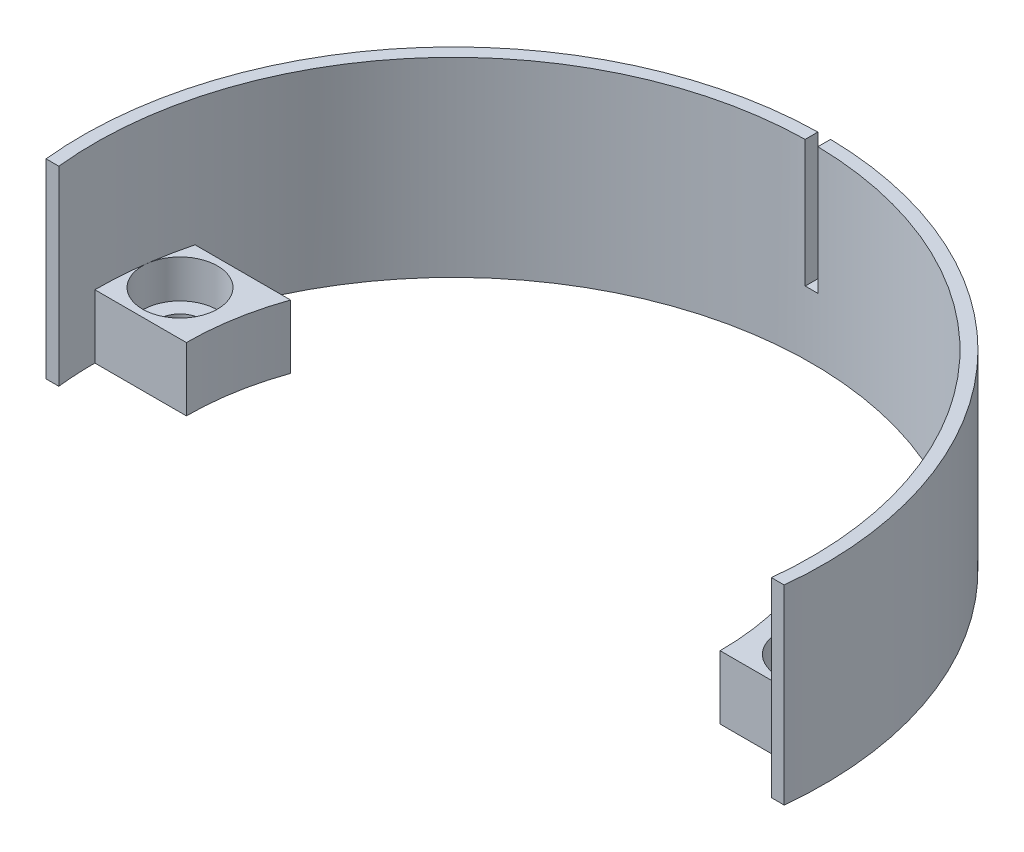
ISO-10303-21;
HEADER;
FILE_DESCRIPTION(('STEP AP214'),'2;1');
FILE_NAME('part.step','',(''),(''),'','','');
FILE_SCHEMA(('AUTOMOTIVE_DESIGN { 1 0 10303 214 1 1 1 1 }'));
ENDSEC;
DATA;
#1=APPLICATION_CONTEXT('core data for automotive mechanical design processes');
#2=APPLICATION_PROTOCOL_DEFINITION('international standard','automotive_design',2000,#1);
#3=PRODUCT_CONTEXT('',#1,'mechanical');
#4=PRODUCT('Part','Part','',(#3));
#5=PRODUCT_RELATED_PRODUCT_CATEGORY('part','',(#4));
#6=PRODUCT_DEFINITION_FORMATION('','',#4);
#7=PRODUCT_DEFINITION_CONTEXT('part definition',#1,'design');
#8=PRODUCT_DEFINITION('design','',#6,#7);
#9=PRODUCT_DEFINITION_SHAPE('','',#8);
#10=(LENGTH_UNIT() NAMED_UNIT(*) SI_UNIT(.MILLI.,.METRE.));
#11=(NAMED_UNIT(*) PLANE_ANGLE_UNIT() SI_UNIT($,.RADIAN.));
#12=(NAMED_UNIT(*) SI_UNIT($,.STERADIAN.) SOLID_ANGLE_UNIT());
#13=UNCERTAINTY_MEASURE_WITH_UNIT(LENGTH_MEASURE(1.E-05),#10,'distance_accuracy_value','');
#14=(GEOMETRIC_REPRESENTATION_CONTEXT(3) GLOBAL_UNCERTAINTY_ASSIGNED_CONTEXT((#13)) GLOBAL_UNIT_ASSIGNED_CONTEXT((#10,
#11,#12)) REPRESENTATION_CONTEXT('',''));
#15=CARTESIAN_POINT('',(0.,0.,0.));
#16=DIRECTION('',(0.,0.,1.));
#17=DIRECTION('',(1.,0.,0.));
#18=AXIS2_PLACEMENT_3D('',#15,#16,#17);
#19=CARTESIAN_POINT('',(-25.,5.,-3.5));
#20=DIRECTION('',(0.,-1.,0.));
#21=DIRECTION('',(0.,0.,-1.));
#22=AXIS2_PLACEMENT_3D('',#19,#20,#21);
#23=CYLINDRICAL_SURFACE('',#22,1.7);
#24=CARTESIAN_POINT('',(-25.,0.,-3.5));
#25=DIRECTION('',(0.,1.,0.));
#26=DIRECTION('',(0.,0.,1.));
#27=AXIS2_PLACEMENT_3D('',#24,#25,#26);
#28=CIRCLE('',#27,1.7);
#29=CARTESIAN_POINT('',(-25.,0.,-1.8));
#30=VERTEX_POINT('',#29);
#31=EDGE_CURVE('E214',#30,#30,#28,.T.);
#32=ORIENTED_EDGE('',*,*,#31,.F.);
#33=EDGE_LOOP('',(#32));
#34=FACE_BOUND('',#33,.T.);
#35=CARTESIAN_POINT('',(-25.,2.,-3.5));
#36=DIRECTION('',(0.,1.,0.));
#37=DIRECTION('',(0.,0.,1.));
#38=AXIS2_PLACEMENT_3D('',#35,#36,#37);
#39=CIRCLE('',#38,1.7);
#40=CARTESIAN_POINT('',(-25.,2.,-1.8));
#41=VERTEX_POINT('',#40);
#42=EDGE_CURVE('E40',#41,#41,#39,.T.);
#43=ORIENTED_EDGE('',*,*,#42,.T.);
#44=EDGE_LOOP('',(#43));
#45=FACE_BOUND('',#44,.T.);
#46=ADVANCED_FACE('F36',(#34,#45),#23,.F.);
#47=CARTESIAN_POINT('',(25.,5.,-3.5));
#48=DIRECTION('',(0.,-1.,0.));
#49=DIRECTION('',(0.,0.,-1.));
#50=AXIS2_PLACEMENT_3D('',#47,#48,#49);
#51=CYLINDRICAL_SURFACE('',#50,1.7);
#52=CARTESIAN_POINT('',(25.,0.,-3.5));
#53=DIRECTION('',(0.,1.,0.));
#54=DIRECTION('',(0.,0.,1.));
#55=AXIS2_PLACEMENT_3D('',#52,#53,#54);
#56=CIRCLE('',#55,1.7);
#57=CARTESIAN_POINT('',(25.,0.,-1.8));
#58=VERTEX_POINT('',#57);
#59=EDGE_CURVE('E211',#58,#58,#56,.T.);
#60=ORIENTED_EDGE('',*,*,#59,.F.);
#61=EDGE_LOOP('',(#60));
#62=FACE_BOUND('',#61,.T.);
#63=CARTESIAN_POINT('',(25.,2.,-3.5));
#64=DIRECTION('',(0.,1.,0.));
#65=DIRECTION('',(0.,0.,1.));
#66=AXIS2_PLACEMENT_3D('',#63,#64,#65);
#67=CIRCLE('',#66,1.7);
#68=CARTESIAN_POINT('',(25.,2.,-1.8));
#69=VERTEX_POINT('',#68);
#70=EDGE_CURVE('E283',#69,#69,#67,.T.);
#71=ORIENTED_EDGE('',*,*,#70,.T.);
#72=EDGE_LOOP('',(#71));
#73=FACE_BOUND('',#72,.T.);
#74=ADVANCED_FACE('F372',(#62,#73),#51,.F.);
#75=CARTESIAN_POINT('',(0.,5.,0.));
#76=DIRECTION('',(0.,1.,0.));
#77=DIRECTION('',(0.,0.,1.));
#78=AXIS2_PLACEMENT_3D('',#75,#76,#77);
#79=PLANE('',#78);
#80=CARTESIAN_POINT('',(-25.,5.,-3.5));
#81=DIRECTION('',(0.,1.,0.));
#82=DIRECTION('',(0.,0.,1.));
#83=AXIS2_PLACEMENT_3D('',#80,#81,#82);
#84=CIRCLE('',#83,2.95);
#85=CARTESIAN_POINT('',(-25.,5.,-0.549999999999999));
#86=VERTEX_POINT('',#85);
#87=EDGE_CURVE('E290',#86,#86,#84,.T.);
#88=ORIENTED_EDGE('',*,*,#87,.F.);
#89=EDGE_LOOP('',(#88));
#90=FACE_BOUND('',#89,.T.);
#91=DIRECTION('',(-1.,0.,0.));
#92=VECTOR('',#91,1.);
#93=CARTESIAN_POINT('',(-27.3173937263422,5.,-7.));
#94=LINE('',#93,#92);
#95=CARTESIAN_POINT('',(-19.7989898732233,5.,-7.));
#96=VERTEX_POINT('',#95);
#97=CARTESIAN_POINT('',(-27.3173937263422,5.,-7.00000000000001));
#98=VERTEX_POINT('',#97);
#99=EDGE_CURVE('E223',#96,#98,#94,.T.);
#100=ORIENTED_EDGE('',*,*,#99,.T.);
#101=CARTESIAN_POINT('',(0.,5.,0.));
#102=DIRECTION('',(0.,-1.,0.));
#103=DIRECTION('',(0.,0.,-1.));
#104=AXIS2_PLACEMENT_3D('',#101,#102,#103);
#105=CIRCLE('',#104,28.2);
#106=CARTESIAN_POINT('',(-28.2,5.,1.96919547510753E-13));
#107=VERTEX_POINT('',#106);
#108=EDGE_CURVE('E176',#107,#98,#105,.T.);
#109=ORIENTED_EDGE('',*,*,#108,.F.);
#110=DIRECTION('',(1.,0.,0.));
#111=VECTOR('',#110,1.);
#112=CARTESIAN_POINT('',(-28.2,5.,1.96919547510753E-13));
#113=LINE('',#112,#111);
#114=CARTESIAN_POINT('',(-21.,5.,0.));
#115=VERTEX_POINT('',#114);
#116=EDGE_CURVE('E218',#107,#115,#113,.T.);
#117=ORIENTED_EDGE('',*,*,#116,.T.);
#118=CARTESIAN_POINT('',(0.,5.,0.));
#119=DIRECTION('',(0.,-1.,0.));
#120=DIRECTION('',(0.,0.,1.));
#121=AXIS2_PLACEMENT_3D('',#118,#119,#120);
#122=CIRCLE('',#121,21.);
#123=EDGE_CURVE('E220',#115,#96,#122,.T.);
#124=ORIENTED_EDGE('',*,*,#123,.T.);
#125=EDGE_LOOP('',(#100,#109,#117,#124));
#126=FACE_BOUND('',#125,.T.);
#127=ADVANCED_FACE('F311',(#90,#126),#79,.T.);
#128=CARTESIAN_POINT('',(0.,5.,0.));
#129=DIRECTION('',(0.,1.,0.));
#130=DIRECTION('',(0.,0.,1.));
#131=AXIS2_PLACEMENT_3D('',#128,#129,#130);
#132=CIRCLE('',#131,29.2);
#133=CARTESIAN_POINT('',(0.499999999999996,5.,-29.1957188642445));
#134=VERTEX_POINT('',#133);
#135=CARTESIAN_POINT('',(-0.500000000000003,5.,-29.1957188642445));
#136=VERTEX_POINT('',#135);
#137=EDGE_CURVE('E58',#134,#136,#132,.T.);
#138=ORIENTED_EDGE('',*,*,#137,.T.);
#139=DIRECTION('',(0.,0.,-1.));
#140=VECTOR('',#139,1.);
#141=CARTESIAN_POINT('',(-0.500000000000003,5.,-29.1957188642445));
#142=LINE('',#141,#140);
#143=CARTESIAN_POINT('',(-0.500000000000003,5.,-28.1955670274602));
#144=VERTEX_POINT('',#143);
#145=EDGE_CURVE('E53',#144,#136,#142,.T.);
#146=ORIENTED_EDGE('',*,*,#145,.F.);
#147=CARTESIAN_POINT('',(0.,5.,0.));
#148=DIRECTION('',(0.,-1.,0.));
#149=DIRECTION('',(0.,0.,1.));
#150=AXIS2_PLACEMENT_3D('',#147,#148,#149);
#151=CIRCLE('',#150,28.2);
#152=CARTESIAN_POINT('',(0.499999999999996,5.,-28.1955670274602));
#153=VERTEX_POINT('',#152);
#154=EDGE_CURVE('E225',#144,#153,#151,.T.);
#155=ORIENTED_EDGE('',*,*,#154,.T.);
#156=DIRECTION('',(0.,0.,1.));
#157=VECTOR('',#156,1.);
#158=CARTESIAN_POINT('',(0.499999999999996,5.,-29.1957188642445));
#159=LINE('',#158,#157);
#160=EDGE_CURVE('E191',#134,#153,#159,.T.);
#161=ORIENTED_EDGE('',*,*,#160,.F.);
#162=EDGE_LOOP('',(#138,#146,#155,#161));
#163=FACE_BOUND('',#162,.T.);
#164=ADVANCED_FACE('F309',(#163),#79,.T.);
#165=CARTESIAN_POINT('',(25.,5.,-3.5));
#166=DIRECTION('',(0.,1.,0.));
#167=DIRECTION('',(0.,0.,1.));
#168=AXIS2_PLACEMENT_3D('',#165,#166,#167);
#169=CIRCLE('',#168,2.95);
#170=CARTESIAN_POINT('',(25.,5.,-0.549999999999999));
#171=VERTEX_POINT('',#170);
#172=EDGE_CURVE('E179',#171,#171,#169,.T.);
#173=ORIENTED_EDGE('',*,*,#172,.F.);
#174=EDGE_LOOP('',(#173));
#175=FACE_BOUND('',#174,.T.);
#176=CARTESIAN_POINT('',(0.,5.,0.));
#177=DIRECTION('',(0.,-1.,0.));
#178=DIRECTION('',(0.,0.,-1.));
#179=AXIS2_PLACEMENT_3D('',#176,#177,#178);
#180=CIRCLE('',#179,28.2);
#181=CARTESIAN_POINT('',(27.3173937263422,5.,-7.));
#182=VERTEX_POINT('',#181);
#183=CARTESIAN_POINT('',(28.2,5.,0.));
#184=VERTEX_POINT('',#183);
#185=EDGE_CURVE('E11',#182,#184,#180,.T.);
#186=ORIENTED_EDGE('',*,*,#185,.F.);
#187=DIRECTION('',(-1.,0.,0.));
#188=VECTOR('',#187,1.);
#189=CARTESIAN_POINT('',(19.7989898732233,5.,-7.));
#190=LINE('',#189,#188);
#191=CARTESIAN_POINT('',(19.7989898732233,5.,-7.));
#192=VERTEX_POINT('',#191);
#193=EDGE_CURVE('E227',#182,#192,#190,.T.);
#194=ORIENTED_EDGE('',*,*,#193,.T.);
#195=CARTESIAN_POINT('',(0.,5.,0.));
#196=DIRECTION('',(0.,-1.,0.));
#197=DIRECTION('',(0.,0.,1.));
#198=AXIS2_PLACEMENT_3D('',#195,#196,#197);
#199=CIRCLE('',#198,21.);
#200=CARTESIAN_POINT('',(21.,5.,0.));
#201=VERTEX_POINT('',#200);
#202=EDGE_CURVE('E229',#192,#201,#199,.T.);
#203=ORIENTED_EDGE('',*,*,#202,.T.);
#204=DIRECTION('',(1.,0.,0.));
#205=VECTOR('',#204,1.);
#206=CARTESIAN_POINT('',(21.,5.,0.));
#207=LINE('',#206,#205);
#208=EDGE_CURVE('E231',#201,#184,#207,.T.);
#209=ORIENTED_EDGE('',*,*,#208,.T.);
#210=EDGE_LOOP('',(#186,#194,#203,#209));
#211=FACE_BOUND('',#210,.T.);
#212=ADVANCED_FACE('F305',(#175,#211),#79,.T.);
#213=CARTESIAN_POINT('',(0.,0.,0.));
#214=DIRECTION('',(0.,1.,0.));
#215=DIRECTION('',(0.,0.,1.));
#216=AXIS2_PLACEMENT_3D('',#213,#214,#215);
#217=PLANE('',#216);
#218=CARTESIAN_POINT('',(0.,0.,0.));
#219=DIRECTION('',(0.,-1.,0.));
#220=DIRECTION('',(0.,0.,1.));
#221=AXIS2_PLACEMENT_3D('',#218,#219,#220);
#222=CIRCLE('',#221,28.2);
#223=CARTESIAN_POINT('',(-28.039971469315,0.,3.));
#224=VERTEX_POINT('',#223);
#225=CARTESIAN_POINT('',(-28.2,0.,1.96919547510753E-13));
#226=VERTEX_POINT('',#225);
#227=EDGE_CURVE('E217',#224,#226,#222,.T.);
#228=ORIENTED_EDGE('',*,*,#227,.F.);
#229=DIRECTION('',(1.,0.,0.));
#230=VECTOR('',#229,1.);
#231=CARTESIAN_POINT('',(-29.0454815763141,0.,3.));
#232=LINE('',#231,#230);
#233=CARTESIAN_POINT('',(-29.0454815763141,0.,3.));
#234=VERTEX_POINT('',#233);
#235=EDGE_CURVE('E221',#234,#224,#232,.T.);
#236=ORIENTED_EDGE('',*,*,#235,.F.);
#237=CARTESIAN_POINT('',(0.,0.,0.));
#238=DIRECTION('',(0.,1.,0.));
#239=DIRECTION('',(0.,0.,1.));
#240=AXIS2_PLACEMENT_3D('',#237,#238,#239);
#241=CIRCLE('',#240,29.2);
#242=CARTESIAN_POINT('',(29.0454815763141,0.,3.));
#243=VERTEX_POINT('',#242);
#244=EDGE_CURVE('E157',#243,#234,#241,.T.);
#245=ORIENTED_EDGE('',*,*,#244,.F.);
#246=DIRECTION('',(1.,0.,0.));
#247=VECTOR('',#246,1.);
#248=CARTESIAN_POINT('',(28.039971469315,0.,3.));
#249=LINE('',#248,#247);
#250=CARTESIAN_POINT('',(28.039971469315,0.,3.));
#251=VERTEX_POINT('',#250);
#252=EDGE_CURVE('E252',#251,#243,#249,.T.);
#253=ORIENTED_EDGE('',*,*,#252,.F.);
#254=CARTESIAN_POINT('',(0.,0.,0.));
#255=DIRECTION('',(0.,-1.,0.));
#256=DIRECTION('',(0.,0.,1.));
#257=AXIS2_PLACEMENT_3D('',#254,#255,#256);
#258=CIRCLE('',#257,28.2);
#259=CARTESIAN_POINT('',(28.2,0.,0.));
#260=VERTEX_POINT('',#259);
#261=EDGE_CURVE('E250',#260,#251,#258,.T.);
#262=ORIENTED_EDGE('',*,*,#261,.F.);
#263=DIRECTION('',(1.,0.,0.));
#264=VECTOR('',#263,1.);
#265=CARTESIAN_POINT('',(21.,0.,0.));
#266=LINE('',#265,#264);
#267=CARTESIAN_POINT('',(21.,0.,0.));
#268=VERTEX_POINT('',#267);
#269=EDGE_CURVE('E248',#268,#260,#266,.T.);
#270=ORIENTED_EDGE('',*,*,#269,.F.);
#271=CARTESIAN_POINT('',(0.,0.,0.));
#272=DIRECTION('',(0.,-1.,0.));
#273=DIRECTION('',(0.,0.,1.));
#274=AXIS2_PLACEMENT_3D('',#271,#272,#273);
#275=CIRCLE('',#274,21.);
#276=CARTESIAN_POINT('',(19.7989898732233,0.,-7.));
#277=VERTEX_POINT('',#276);
#278=EDGE_CURVE('E246',#277,#268,#275,.T.);
#279=ORIENTED_EDGE('',*,*,#278,.F.);
#280=DIRECTION('',(-1.,0.,0.));
#281=VECTOR('',#280,1.);
#282=CARTESIAN_POINT('',(19.7989898732233,0.,-7.));
#283=LINE('',#282,#281);
#284=CARTESIAN_POINT('',(27.3173937263422,0.,-7.));
#285=VERTEX_POINT('',#284);
#286=EDGE_CURVE('E244',#285,#277,#283,.T.);
#287=ORIENTED_EDGE('',*,*,#286,.F.);
#288=CARTESIAN_POINT('',(0.,0.,0.));
#289=DIRECTION('',(0.,-1.,0.));
#290=DIRECTION('',(0.,0.,1.));
#291=AXIS2_PLACEMENT_3D('',#288,#289,#290);
#292=CIRCLE('',#291,28.2);
#293=CARTESIAN_POINT('',(-27.3173937263422,0.,-7.00000000000001));
#294=VERTEX_POINT('',#293);
#295=EDGE_CURVE('E242',#294,#285,#292,.T.);
#296=ORIENTED_EDGE('',*,*,#295,.F.);
#297=DIRECTION('',(-1.,0.,0.));
#298=VECTOR('',#297,1.);
#299=CARTESIAN_POINT('',(-27.3173937263422,0.,-7.));
#300=LINE('',#299,#298);
#301=CARTESIAN_POINT('',(-19.7989898732233,0.,-7.));
#302=VERTEX_POINT('',#301);
#303=EDGE_CURVE('E240',#302,#294,#300,.T.);
#304=ORIENTED_EDGE('',*,*,#303,.F.);
#305=CARTESIAN_POINT('',(0.,0.,0.));
#306=DIRECTION('',(0.,-1.,0.));
#307=DIRECTION('',(0.,0.,1.));
#308=AXIS2_PLACEMENT_3D('',#305,#306,#307);
#309=CIRCLE('',#308,21.);
#310=CARTESIAN_POINT('',(-21.,0.,0.));
#311=VERTEX_POINT('',#310);
#312=EDGE_CURVE('E238',#311,#302,#309,.T.);
#313=ORIENTED_EDGE('',*,*,#312,.F.);
#314=DIRECTION('',(1.,0.,0.));
#315=VECTOR('',#314,1.);
#316=CARTESIAN_POINT('',(-28.2,0.,1.96919547510753E-13));
#317=LINE('',#316,#315);
#318=EDGE_CURVE('E236',#226,#311,#317,.T.);
#319=ORIENTED_EDGE('',*,*,#318,.F.);
#320=EDGE_LOOP('',(#228,#236,#245,#253,#262,#270,#279,#287,#296,#304,#313,#319));
#321=FACE_BOUND('',#320,.T.);
#322=ORIENTED_EDGE('',*,*,#31,.T.);
#323=EDGE_LOOP('',(#322));
#324=FACE_BOUND('',#323,.T.);
#325=ORIENTED_EDGE('',*,*,#59,.T.);
#326=EDGE_LOOP('',(#325));
#327=FACE_BOUND('',#326,.T.);
#328=ADVANCED_FACE('F308',(#321,#324,#327),#217,.F.);
#329=CARTESIAN_POINT('',(-28.2,5.,1.96919547510753E-13));
#330=DIRECTION('',(0.,0.,-1.));
#331=DIRECTION('',(-1.,0.,0.));
#332=AXIS2_PLACEMENT_3D('',#329,#330,#331);
#333=PLANE('',#332);
#334=ORIENTED_EDGE('',*,*,#318,.T.);
#335=DIRECTION('',(0.,-1.,0.));
#336=VECTOR('',#335,1.);
#337=CARTESIAN_POINT('',(-21.,5.,0.));
#338=LINE('',#337,#336);
#339=EDGE_CURVE('E279',#115,#311,#338,.T.);
#340=ORIENTED_EDGE('',*,*,#339,.F.);
#341=ORIENTED_EDGE('',*,*,#116,.F.);
#342=DIRECTION('',(0.,-1.,0.));
#343=VECTOR('',#342,1.);
#344=CARTESIAN_POINT('',(-28.2,5.,1.96919547510753E-13));
#345=LINE('',#344,#343);
#346=EDGE_CURVE('E45',#107,#226,#345,.T.);
#347=ORIENTED_EDGE('',*,*,#346,.T.);
#348=EDGE_LOOP('',(#334,#340,#341,#347));
#349=FACE_BOUND('',#348,.T.);
#350=ADVANCED_FACE('F38',(#349),#333,.F.);
#351=CARTESIAN_POINT('',(0.,5.,0.));
#352=DIRECTION('',(0.,-1.,0.));
#353=DIRECTION('',(0.,0.,-1.));
#354=AXIS2_PLACEMENT_3D('',#351,#352,#353);
#355=CYLINDRICAL_SURFACE('',#354,21.);
#356=ORIENTED_EDGE('',*,*,#312,.T.);
#357=DIRECTION('',(0.,-1.,0.));
#358=VECTOR('',#357,1.);
#359=CARTESIAN_POINT('',(-19.7989898732233,5.,-7.));
#360=LINE('',#359,#358);
#361=EDGE_CURVE('E276',#96,#302,#360,.T.);
#362=ORIENTED_EDGE('',*,*,#361,.F.);
#363=ORIENTED_EDGE('',*,*,#123,.F.);
#364=ORIENTED_EDGE('',*,*,#339,.T.);
#365=EDGE_LOOP('',(#356,#362,#363,#364));
#366=FACE_BOUND('',#365,.T.);
#367=ADVANCED_FACE('F364',(#366),#355,.F.);
#368=CARTESIAN_POINT('',(-27.3173937263422,5.,-7.));
#369=DIRECTION('',(0.,0.,1.));
#370=DIRECTION('',(1.,0.,0.));
#371=AXIS2_PLACEMENT_3D('',#368,#369,#370);
#372=PLANE('',#371);
#373=ORIENTED_EDGE('',*,*,#303,.T.);
#374=DIRECTION('',(0.,-1.,0.));
#375=VECTOR('',#374,1.);
#376=CARTESIAN_POINT('',(-27.3173937263422,5.,-7.00000000000001));
#377=LINE('',#376,#375);
#378=EDGE_CURVE('E273',#98,#294,#377,.T.);
#379=ORIENTED_EDGE('',*,*,#378,.F.);
#380=ORIENTED_EDGE('',*,*,#99,.F.);
#381=ORIENTED_EDGE('',*,*,#361,.T.);
#382=EDGE_LOOP('',(#373,#379,#380,#381));
#383=FACE_BOUND('',#382,.T.);
#384=ADVANCED_FACE('F362',(#383),#372,.F.);
#385=CARTESIAN_POINT('',(19.7989898732233,5.,-7.));
#386=DIRECTION('',(0.,0.,1.));
#387=DIRECTION('',(1.,0.,0.));
#388=AXIS2_PLACEMENT_3D('',#385,#386,#387);
#389=PLANE('',#388);
#390=ORIENTED_EDGE('',*,*,#286,.T.);
#391=DIRECTION('',(0.,-1.,0.));
#392=VECTOR('',#391,1.);
#393=CARTESIAN_POINT('',(19.7989898732233,5.,-7.));
#394=LINE('',#393,#392);
#395=EDGE_CURVE('E267',#192,#277,#394,.T.);
#396=ORIENTED_EDGE('',*,*,#395,.F.);
#397=ORIENTED_EDGE('',*,*,#193,.F.);
#398=DIRECTION('',(0.,-1.,0.));
#399=VECTOR('',#398,1.);
#400=CARTESIAN_POINT('',(27.3173937263422,5.,-7.));
#401=LINE('',#400,#399);
#402=EDGE_CURVE('E270',#182,#285,#401,.T.);
#403=ORIENTED_EDGE('',*,*,#402,.T.);
#404=EDGE_LOOP('',(#390,#396,#397,#403));
#405=FACE_BOUND('',#404,.T.);
#406=ADVANCED_FACE('F322',(#405),#389,.F.);
#407=CARTESIAN_POINT('',(0.,5.,0.));
#408=DIRECTION('',(0.,-1.,0.));
#409=DIRECTION('',(0.,0.,-1.));
#410=AXIS2_PLACEMENT_3D('',#407,#408,#409);
#411=CYLINDRICAL_SURFACE('',#410,21.);
#412=ORIENTED_EDGE('',*,*,#278,.T.);
#413=DIRECTION('',(0.,-1.,0.));
#414=VECTOR('',#413,1.);
#415=CARTESIAN_POINT('',(21.,5.,0.));
#416=LINE('',#415,#414);
#417=EDGE_CURVE('E264',#201,#268,#416,.T.);
#418=ORIENTED_EDGE('',*,*,#417,.F.);
#419=ORIENTED_EDGE('',*,*,#202,.F.);
#420=ORIENTED_EDGE('',*,*,#395,.T.);
#421=EDGE_LOOP('',(#412,#418,#419,#420));
#422=FACE_BOUND('',#421,.T.);
#423=ADVANCED_FACE('F327',(#422),#411,.F.);
#424=CARTESIAN_POINT('',(21.,5.,0.));
#425=DIRECTION('',(0.,0.,-1.));
#426=DIRECTION('',(-1.,0.,0.));
#427=AXIS2_PLACEMENT_3D('',#424,#425,#426);
#428=PLANE('',#427);
#429=ORIENTED_EDGE('',*,*,#269,.T.);
#430=DIRECTION('',(0.,-1.,0.));
#431=VECTOR('',#430,1.);
#432=CARTESIAN_POINT('',(28.2,5.,0.));
#433=LINE('',#432,#431);
#434=EDGE_CURVE('E261',#184,#260,#433,.T.);
#435=ORIENTED_EDGE('',*,*,#434,.F.);
#436=ORIENTED_EDGE('',*,*,#208,.F.);
#437=ORIENTED_EDGE('',*,*,#417,.T.);
#438=EDGE_LOOP('',(#429,#435,#436,#437));
#439=FACE_BOUND('',#438,.T.);
#440=ADVANCED_FACE('F330',(#439),#428,.F.);
#441=CARTESIAN_POINT('',(0.,5.,0.));
#442=DIRECTION('',(0.,-1.,0.));
#443=DIRECTION('',(0.,0.,-1.));
#444=AXIS2_PLACEMENT_3D('',#441,#442,#443);
#445=CYLINDRICAL_SURFACE('',#444,28.2);
#446=ORIENTED_EDGE('',*,*,#261,.T.);
#447=DIRECTION('',(0.,-1.,0.));
#448=VECTOR('',#447,1.);
#449=CARTESIAN_POINT('',(28.039971469315,5.,3.));
#450=LINE('',#449,#448);
#451=CARTESIAN_POINT('',(28.039971469315,15.,3.));
#452=VERTEX_POINT('',#451);
#453=EDGE_CURVE('E258',#452,#251,#450,.T.);
#454=ORIENTED_EDGE('',*,*,#453,.F.);
#455=CARTESIAN_POINT('',(0.,15.,0.));
#456=DIRECTION('',(0.,-1.,0.));
#457=DIRECTION('',(0.,0.,-1.));
#458=AXIS2_PLACEMENT_3D('',#455,#456,#457);
#459=CIRCLE('',#458,28.2);
#460=CARTESIAN_POINT('',(0.499999999999996,15.,-28.1955670274602));
#461=VERTEX_POINT('',#460);
#462=EDGE_CURVE('E197',#461,#452,#459,.T.);
#463=ORIENTED_EDGE('',*,*,#462,.F.);
#464=DIRECTION('',(0.,-1.,0.));
#465=VECTOR('',#464,1.);
#466=CARTESIAN_POINT('',(0.499999999999996,15.,-28.1955670274602));
#467=LINE('',#466,#465);
#468=EDGE_CURVE('E203',#461,#153,#467,.T.);
#469=ORIENTED_EDGE('',*,*,#468,.T.);
#470=ORIENTED_EDGE('',*,*,#154,.F.);
#471=DIRECTION('',(0.,-1.,0.));
#472=VECTOR('',#471,1.);
#473=CARTESIAN_POINT('',(-0.500000000000018,15.,-28.1955670274602));
#474=LINE('',#473,#472);
#475=CARTESIAN_POINT('',(-0.500000000000018,15.,-28.1955670274602));
#476=VERTEX_POINT('',#475);
#477=EDGE_CURVE('E188',#476,#144,#474,.T.);
#478=ORIENTED_EDGE('',*,*,#477,.F.);
#479=CARTESIAN_POINT('',(0.,15.,0.));
#480=DIRECTION('',(0.,-1.,0.));
#481=DIRECTION('',(0.,0.,-1.));
#482=AXIS2_PLACEMENT_3D('',#479,#480,#481);
#483=CIRCLE('',#482,28.2);
#484=CARTESIAN_POINT('',(-28.039971469315,15.,3.));
#485=VERTEX_POINT('',#484);
#486=EDGE_CURVE('E169',#485,#476,#483,.T.);
#487=ORIENTED_EDGE('',*,*,#486,.F.);
#488=DIRECTION('',(0.,-1.,0.));
#489=VECTOR('',#488,1.);
#490=CARTESIAN_POINT('',(-28.039971469315,5.,3.));
#491=LINE('',#490,#489);
#492=EDGE_CURVE('E161',#485,#224,#491,.T.);
#493=ORIENTED_EDGE('',*,*,#492,.T.);
#494=ORIENTED_EDGE('',*,*,#227,.T.);
#495=ORIENTED_EDGE('',*,*,#346,.F.);
#496=ORIENTED_EDGE('',*,*,#108,.T.);
#497=ORIENTED_EDGE('',*,*,#378,.T.);
#498=ORIENTED_EDGE('',*,*,#295,.T.);
#499=ORIENTED_EDGE('',*,*,#402,.F.);
#500=ORIENTED_EDGE('',*,*,#185,.T.);
#501=ORIENTED_EDGE('',*,*,#434,.T.);
#502=EDGE_LOOP('',(#446,#454,#463,#469,#470,#478,#487,#493,#494,#495,#496,#497,#498,#499,#500,#501));
#503=FACE_BOUND('',#502,.T.);
#504=ADVANCED_FACE('F318',(#503),#445,.F.);
#505=CARTESIAN_POINT('',(28.039971469315,5.,3.));
#506=DIRECTION('',(0.,0.,-1.));
#507=DIRECTION('',(-1.,0.,0.));
#508=AXIS2_PLACEMENT_3D('',#505,#506,#507);
#509=PLANE('',#508);
#510=ORIENTED_EDGE('',*,*,#252,.T.);
#511=DIRECTION('',(0.,-1.,0.));
#512=VECTOR('',#511,1.);
#513=CARTESIAN_POINT('',(29.0454815763141,5.,3.));
#514=LINE('',#513,#512);
#515=CARTESIAN_POINT('',(29.0454815763141,15.,3.));
#516=VERTEX_POINT('',#515);
#517=EDGE_CURVE('E160',#516,#243,#514,.T.);
#518=ORIENTED_EDGE('',*,*,#517,.F.);
#519=DIRECTION('',(1.,0.,0.));
#520=VECTOR('',#519,1.);
#521=CARTESIAN_POINT('',(28.039971469315,15.,3.));
#522=LINE('',#521,#520);
#523=EDGE_CURVE('E200',#452,#516,#522,.T.);
#524=ORIENTED_EDGE('',*,*,#523,.F.);
#525=ORIENTED_EDGE('',*,*,#453,.T.);
#526=EDGE_LOOP('',(#510,#518,#524,#525));
#527=FACE_BOUND('',#526,.T.);
#528=ADVANCED_FACE('F337',(#527),#509,.F.);
#529=CARTESIAN_POINT('',(0.,5.,0.));
#530=DIRECTION('',(0.,-1.,0.));
#531=DIRECTION('',(0.,0.,-1.));
#532=AXIS2_PLACEMENT_3D('',#529,#530,#531);
#533=CYLINDRICAL_SURFACE('',#532,29.2);
#534=ORIENTED_EDGE('',*,*,#244,.T.);
#535=DIRECTION('',(0.,-1.,0.));
#536=VECTOR('',#535,1.);
#537=CARTESIAN_POINT('',(-29.0454815763141,5.,3.));
#538=LINE('',#537,#536);
#539=CARTESIAN_POINT('',(-29.0454815763141,15.,3.));
#540=VERTEX_POINT('',#539);
#541=EDGE_CURVE('E149',#540,#234,#538,.T.);
#542=ORIENTED_EDGE('',*,*,#541,.F.);
#543=CARTESIAN_POINT('',(0.,15.,0.));
#544=DIRECTION('',(0.,1.,0.));
#545=DIRECTION('',(0.,0.,1.));
#546=AXIS2_PLACEMENT_3D('',#543,#544,#545);
#547=CIRCLE('',#546,29.2);
#548=CARTESIAN_POINT('',(-0.500000000000003,15.,-29.1957188642445));
#549=VERTEX_POINT('',#548);
#550=EDGE_CURVE('E154',#549,#540,#547,.T.);
#551=ORIENTED_EDGE('',*,*,#550,.F.);
#552=DIRECTION('',(0.,-1.,0.));
#553=VECTOR('',#552,1.);
#554=CARTESIAN_POINT('',(-0.500000000000003,15.,-29.1957188642445));
#555=LINE('',#554,#553);
#556=EDGE_CURVE('E184',#549,#136,#555,.T.);
#557=ORIENTED_EDGE('',*,*,#556,.T.);
#558=ORIENTED_EDGE('',*,*,#137,.F.);
#559=DIRECTION('',(0.,-1.,0.));
#560=VECTOR('',#559,1.);
#561=CARTESIAN_POINT('',(0.499999999999996,15.,-29.1957188642445));
#562=LINE('',#561,#560);
#563=CARTESIAN_POINT('',(0.499999999999996,15.,-29.1957188642445));
#564=VERTEX_POINT('',#563);
#565=EDGE_CURVE('E208',#564,#134,#562,.T.);
#566=ORIENTED_EDGE('',*,*,#565,.F.);
#567=CARTESIAN_POINT('',(0.,15.,0.));
#568=DIRECTION('',(0.,1.,0.));
#569=DIRECTION('',(0.,0.,1.));
#570=AXIS2_PLACEMENT_3D('',#567,#568,#569);
#571=CIRCLE('',#570,29.2);
#572=EDGE_CURVE('E192',#516,#564,#571,.T.);
#573=ORIENTED_EDGE('',*,*,#572,.F.);
#574=ORIENTED_EDGE('',*,*,#517,.T.);
#575=EDGE_LOOP('',(#534,#542,#551,#557,#558,#566,#573,#574));
#576=FACE_BOUND('',#575,.T.);
#577=ADVANCED_FACE('F151',(#576),#533,.T.);
#578=CARTESIAN_POINT('',(-29.0454815763141,5.,3.));
#579=DIRECTION('',(0.,0.,-1.));
#580=DIRECTION('',(-1.,0.,0.));
#581=AXIS2_PLACEMENT_3D('',#578,#579,#580);
#582=PLANE('',#581);
#583=ORIENTED_EDGE('',*,*,#235,.T.);
#584=ORIENTED_EDGE('',*,*,#492,.F.);
#585=DIRECTION('',(1.,0.,0.));
#586=VECTOR('',#585,1.);
#587=CARTESIAN_POINT('',(-29.0454815763141,15.,3.));
#588=LINE('',#587,#586);
#589=EDGE_CURVE('E164',#540,#485,#588,.T.);
#590=ORIENTED_EDGE('',*,*,#589,.F.);
#591=ORIENTED_EDGE('',*,*,#541,.T.);
#592=EDGE_LOOP('',(#583,#584,#590,#591));
#593=FACE_BOUND('',#592,.T.);
#594=ADVANCED_FACE('F165',(#593),#582,.F.);
#595=CARTESIAN_POINT('',(0.499999999999996,15.,-29.1957188642445));
#596=DIRECTION('',(1.,0.,0.));
#597=DIRECTION('',(0.,0.,-1.));
#598=AXIS2_PLACEMENT_3D('',#595,#596,#597);
#599=PLANE('',#598);
#600=ORIENTED_EDGE('',*,*,#160,.T.);
#601=ORIENTED_EDGE('',*,*,#468,.F.);
#602=DIRECTION('',(0.,0.,1.));
#603=VECTOR('',#602,1.);
#604=CARTESIAN_POINT('',(0.499999999999996,15.,-29.1957188642445));
#605=LINE('',#604,#603);
#606=EDGE_CURVE('E195',#564,#461,#605,.T.);
#607=ORIENTED_EDGE('',*,*,#606,.F.);
#608=ORIENTED_EDGE('',*,*,#565,.T.);
#609=EDGE_LOOP('',(#600,#601,#607,#608));
#610=FACE_BOUND('',#609,.T.);
#611=ADVANCED_FACE('F347',(#610),#599,.F.);
#612=CARTESIAN_POINT('',(0.,15.,0.));
#613=DIRECTION('',(0.,1.,0.));
#614=DIRECTION('',(0.,0.,1.));
#615=AXIS2_PLACEMENT_3D('',#612,#613,#614);
#616=PLANE('',#615);
#617=ORIENTED_EDGE('',*,*,#572,.T.);
#618=ORIENTED_EDGE('',*,*,#606,.T.);
#619=ORIENTED_EDGE('',*,*,#462,.T.);
#620=ORIENTED_EDGE('',*,*,#523,.T.);
#621=EDGE_LOOP('',(#617,#618,#619,#620));
#622=FACE_BOUND('',#621,.T.);
#623=ADVANCED_FACE('F342',(#622),#616,.T.);
#624=CARTESIAN_POINT('',(-0.500000000000003,15.,-29.1957188642445));
#625=DIRECTION('',(-1.,0.,0.));
#626=DIRECTION('',(0.,0.,1.));
#627=AXIS2_PLACEMENT_3D('',#624,#625,#626);
#628=PLANE('',#627);
#629=ORIENTED_EDGE('',*,*,#145,.T.);
#630=ORIENTED_EDGE('',*,*,#556,.F.);
#631=DIRECTION('',(0.,0.,-1.));
#632=VECTOR('',#631,1.);
#633=CARTESIAN_POINT('',(-0.500000000000003,15.,-29.1957188642445));
#634=LINE('',#633,#632);
#635=EDGE_CURVE('E173',#476,#549,#634,.T.);
#636=ORIENTED_EDGE('',*,*,#635,.F.);
#637=ORIENTED_EDGE('',*,*,#477,.T.);
#638=EDGE_LOOP('',(#629,#630,#636,#637));
#639=FACE_BOUND('',#638,.T.);
#640=ADVANCED_FACE('F349',(#639),#628,.F.);
#641=CARTESIAN_POINT('',(0.,15.,0.));
#642=DIRECTION('',(0.,1.,0.));
#643=DIRECTION('',(0.,0.,1.));
#644=AXIS2_PLACEMENT_3D('',#641,#642,#643);
#645=PLANE('',#644);
#646=ORIENTED_EDGE('',*,*,#550,.T.);
#647=ORIENTED_EDGE('',*,*,#589,.T.);
#648=ORIENTED_EDGE('',*,*,#486,.T.);
#649=ORIENTED_EDGE('',*,*,#635,.T.);
#650=EDGE_LOOP('',(#646,#647,#648,#649));
#651=FACE_BOUND('',#650,.T.);
#652=ADVANCED_FACE('F171',(#651),#645,.T.);
#653=CARTESIAN_POINT('',(25.,2.,-3.5));
#654=DIRECTION('',(0.,1.,0.));
#655=DIRECTION('',(0.,0.,1.));
#656=AXIS2_PLACEMENT_3D('',#653,#654,#655);
#657=CYLINDRICAL_SURFACE('',#656,2.95);
#658=CARTESIAN_POINT('',(25.,2.,-3.5));
#659=DIRECTION('',(0.,1.,0.));
#660=DIRECTION('',(0.,0.,1.));
#661=AXIS2_PLACEMENT_3D('',#658,#659,#660);
#662=CIRCLE('',#661,2.95);
#663=CARTESIAN_POINT('',(25.,2.,-0.549999999999999));
#664=VERTEX_POINT('',#663);
#665=EDGE_CURVE('E295',#664,#664,#662,.T.);
#666=ORIENTED_EDGE('',*,*,#665,.F.);
#667=EDGE_LOOP('',(#666));
#668=FACE_BOUND('',#667,.T.);
#669=ORIENTED_EDGE('',*,*,#172,.T.);
#670=EDGE_LOOP('',(#669));
#671=FACE_BOUND('',#670,.T.);
#672=ADVANCED_FACE('F303',(#668,#671),#657,.F.);
#673=CARTESIAN_POINT('',(25.,2.,-3.5));
#674=DIRECTION('',(0.,1.,0.));
#675=DIRECTION('',(0.,0.,1.));
#676=AXIS2_PLACEMENT_3D('',#673,#674,#675);
#677=PLANE('',#676);
#678=ORIENTED_EDGE('',*,*,#70,.F.);
#679=EDGE_LOOP('',(#678));
#680=FACE_BOUND('',#679,.T.);
#681=ORIENTED_EDGE('',*,*,#665,.T.);
#682=EDGE_LOOP('',(#681));
#683=FACE_BOUND('',#682,.T.);
#684=ADVANCED_FACE('F459',(#680,#683),#677,.T.);
#685=CARTESIAN_POINT('',(-25.,2.,-3.5));
#686=DIRECTION('',(0.,1.,0.));
#687=DIRECTION('',(0.,0.,1.));
#688=AXIS2_PLACEMENT_3D('',#685,#686,#687);
#689=CYLINDRICAL_SURFACE('',#688,2.95);
#690=CARTESIAN_POINT('',(-25.,2.,-3.5));
#691=DIRECTION('',(0.,1.,0.));
#692=DIRECTION('',(0.,0.,1.));
#693=AXIS2_PLACEMENT_3D('',#690,#691,#692);
#694=CIRCLE('',#693,2.95);
#695=CARTESIAN_POINT('',(-25.,2.,-0.549999999999999));
#696=VERTEX_POINT('',#695);
#697=EDGE_CURVE('E285',#696,#696,#694,.T.);
#698=ORIENTED_EDGE('',*,*,#697,.F.);
#699=EDGE_LOOP('',(#698));
#700=FACE_BOUND('',#699,.T.);
#701=ORIENTED_EDGE('',*,*,#87,.T.);
#702=EDGE_LOOP('',(#701));
#703=FACE_BOUND('',#702,.T.);
#704=ADVANCED_FACE('F468',(#700,#703),#689,.F.);
#705=CARTESIAN_POINT('',(-25.,2.,-3.5));
#706=DIRECTION('',(0.,1.,0.));
#707=DIRECTION('',(0.,0.,1.));
#708=AXIS2_PLACEMENT_3D('',#705,#706,#707);
#709=PLANE('',#708);
#710=ORIENTED_EDGE('',*,*,#42,.F.);
#711=EDGE_LOOP('',(#710));
#712=FACE_BOUND('',#711,.T.);
#713=ORIENTED_EDGE('',*,*,#697,.T.);
#714=EDGE_LOOP('',(#713));
#715=FACE_BOUND('',#714,.T.);
#716=ADVANCED_FACE('F476',(#712,#715),#709,.T.);
#717=CLOSED_SHELL('',(#46,#74,#127,#164,#212,#328,#350,#367,#384,#406,#423,#440,#504,#528,#577,
#594,#611,#623,#640,#652,#672,#684,#704,#716));
#718=MANIFOLD_SOLID_BREP('B2',#717);
#719=ADVANCED_BREP_SHAPE_REPRESENTATION('',(#18,#718),#14);
#720=SHAPE_DEFINITION_REPRESENTATION(#9,#719);
ENDSEC;
END-ISO-10303-21;
